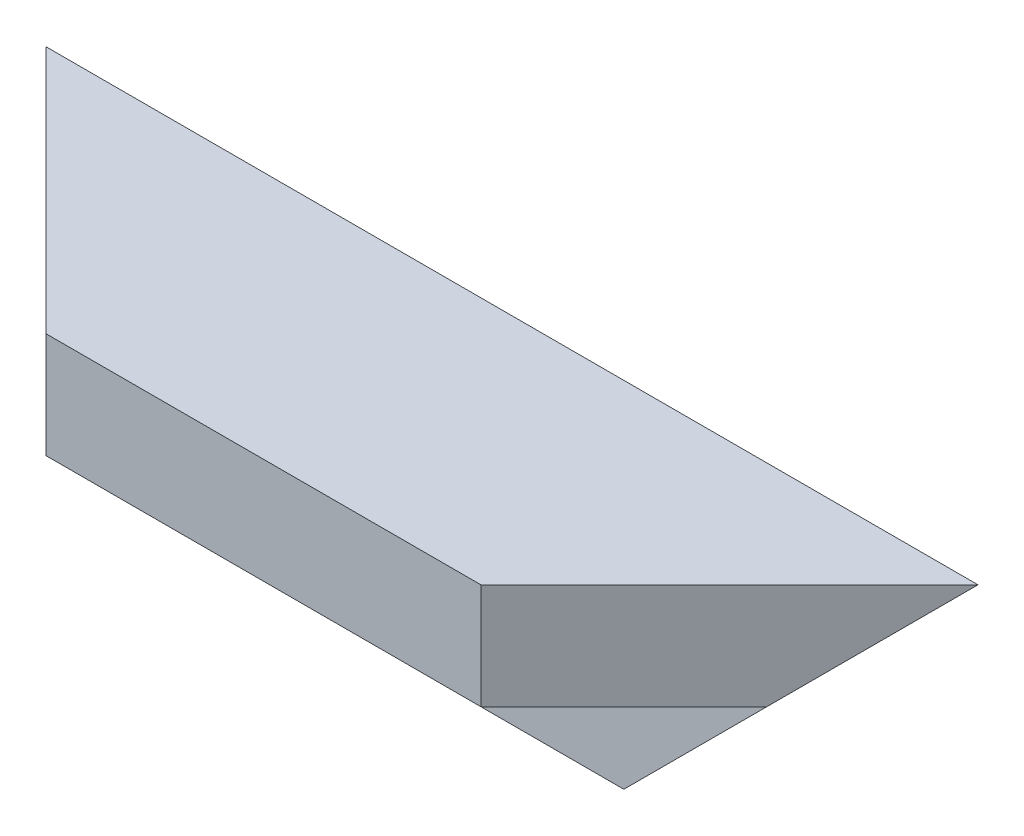
ISO-10303-21;
HEADER;
FILE_DESCRIPTION(('STEP AP214'),'2;1');
FILE_NAME('part.step','',(''),(''),'','','');
FILE_SCHEMA(('AUTOMOTIVE_DESIGN { 1 0 10303 214 1 1 1 1 }'));
ENDSEC;
DATA;
#1=APPLICATION_CONTEXT('core data for automotive mechanical design processes');
#2=APPLICATION_PROTOCOL_DEFINITION('international standard','automotive_design',2000,#1);
#3=PRODUCT_CONTEXT('',#1,'mechanical');
#4=PRODUCT('Part','Part','',(#3));
#5=PRODUCT_RELATED_PRODUCT_CATEGORY('part','',(#4));
#6=PRODUCT_DEFINITION_FORMATION('','',#4);
#7=PRODUCT_DEFINITION_CONTEXT('part definition',#1,'design');
#8=PRODUCT_DEFINITION('design','',#6,#7);
#9=PRODUCT_DEFINITION_SHAPE('','',#8);
#10=(LENGTH_UNIT() NAMED_UNIT(*) SI_UNIT(.MILLI.,.METRE.));
#11=(NAMED_UNIT(*) PLANE_ANGLE_UNIT() SI_UNIT($,.RADIAN.));
#12=(NAMED_UNIT(*) SI_UNIT($,.STERADIAN.) SOLID_ANGLE_UNIT());
#13=UNCERTAINTY_MEASURE_WITH_UNIT(LENGTH_MEASURE(1.E-05),#10,'distance_accuracy_value','');
#14=(GEOMETRIC_REPRESENTATION_CONTEXT(3) GLOBAL_UNCERTAINTY_ASSIGNED_CONTEXT((#13)) GLOBAL_UNIT_ASSIGNED_CONTEXT((#10,
#11,#12)) REPRESENTATION_CONTEXT('',''));
#15=CARTESIAN_POINT('',(0.,0.,0.));
#16=DIRECTION('',(0.,0.,1.));
#17=DIRECTION('',(1.,0.,0.));
#18=AXIS2_PLACEMENT_3D('',#15,#16,#17);
#19=CARTESIAN_POINT('',(150.,-40.,0.));
#20=DIRECTION('',(0.,0.,1.));
#21=DIRECTION('',(1.,0.,0.));
#22=AXIS2_PLACEMENT_3D('',#19,#20,#21);
#23=PLANE('',#22);
#24=DIRECTION('',(-1.,0.,0.));
#25=VECTOR('',#24,1.);
#26=CARTESIAN_POINT('',(150.,0.,0.));
#27=LINE('',#26,#25);
#28=CARTESIAN_POINT('',(150.,0.,0.));
#29=VERTEX_POINT('',#28);
#30=CARTESIAN_POINT('',(0.,0.,0.));
#31=VERTEX_POINT('',#30);
#32=EDGE_CURVE('E110',#29,#31,#27,.T.);
#33=ORIENTED_EDGE('',*,*,#32,.F.);
#34=DIRECTION('',(0.707106781186548,0.707106781186547,0.));
#35=VECTOR('',#34,1.);
#36=CARTESIAN_POINT('',(150.,0.,0.));
#37=LINE('',#36,#35);
#38=CARTESIAN_POINT('',(110.,-40.,0.));
#39=VERTEX_POINT('',#38);
#40=EDGE_CURVE('E94',#39,#29,#37,.T.);
#41=ORIENTED_EDGE('',*,*,#40,.F.);
#42=DIRECTION('',(-1.,0.,0.));
#43=VECTOR('',#42,1.);
#44=CARTESIAN_POINT('',(150.,-40.,0.));
#45=LINE('',#44,#43);
#46=CARTESIAN_POINT('',(40.,-40.,0.));
#47=VERTEX_POINT('',#46);
#48=EDGE_CURVE('E108',#39,#47,#45,.T.);
#49=ORIENTED_EDGE('',*,*,#48,.T.);
#50=DIRECTION('',(0.707106781186548,-0.707106781186548,0.));
#51=VECTOR('',#50,1.);
#52=CARTESIAN_POINT('',(0.,0.,0.));
#53=LINE('',#52,#51);
#54=EDGE_CURVE('E176',#31,#47,#53,.T.);
#55=ORIENTED_EDGE('',*,*,#54,.F.);
#56=EDGE_LOOP('',(#33,#41,#49,#55));
#57=FACE_BOUND('',#56,.T.);
#58=ADVANCED_FACE('F39',(#57),#23,.F.);
#59=CARTESIAN_POINT('',(150.,0.,0.));
#60=DIRECTION('',(0.,-1.,0.));
#61=DIRECTION('',(0.,0.,-1.));
#62=AXIS2_PLACEMENT_3D('',#59,#60,#61);
#63=PLANE('',#62);
#64=DIRECTION('',(-1.,0.,0.));
#65=VECTOR('',#64,1.);
#66=CARTESIAN_POINT('',(150.,0.,40.));
#67=LINE('',#66,#65);
#68=CARTESIAN_POINT('',(110.,0.,40.));
#69=VERTEX_POINT('',#68);
#70=CARTESIAN_POINT('',(40.,0.,40.));
#71=VERTEX_POINT('',#70);
#72=EDGE_CURVE('E135',#69,#71,#67,.T.);
#73=ORIENTED_EDGE('',*,*,#72,.F.);
#74=DIRECTION('',(-0.707106781186548,0.,0.707106781186547));
#75=VECTOR('',#74,1.);
#76=CARTESIAN_POINT('',(150.,0.,0.));
#77=LINE('',#76,#75);
#78=EDGE_CURVE('E143',#29,#69,#77,.T.);
#79=ORIENTED_EDGE('',*,*,#78,.F.);
#80=ORIENTED_EDGE('',*,*,#32,.T.);
#81=DIRECTION('',(-0.707106781186548,0.,-0.707106781186547));
#82=VECTOR('',#81,1.);
#83=CARTESIAN_POINT('',(40.,0.,40.));
#84=LINE('',#83,#82);
#85=EDGE_CURVE('E155',#71,#31,#84,.T.);
#86=ORIENTED_EDGE('',*,*,#85,.F.);
#87=EDGE_LOOP('',(#73,#79,#80,#86));
#88=FACE_BOUND('',#87,.T.);
#89=ADVANCED_FACE('F147',(#88),#63,.F.);
#90=CARTESIAN_POINT('',(150.,0.,40.));
#91=DIRECTION('',(0.,0.,-1.));
#92=DIRECTION('',(-1.,0.,0.));
#93=AXIS2_PLACEMENT_3D('',#90,#91,#92);
#94=PLANE('',#93);
#95=DIRECTION('',(-1.,0.,0.));
#96=VECTOR('',#95,1.);
#97=CARTESIAN_POINT('',(150.,-17.,40.));
#98=LINE('',#97,#96);
#99=CARTESIAN_POINT('',(110.,-17.,40.));
#100=VERTEX_POINT('',#99);
#101=CARTESIAN_POINT('',(40.,-17.,40.));
#102=VERTEX_POINT('',#101);
#103=EDGE_CURVE('E131',#100,#102,#98,.T.);
#104=ORIENTED_EDGE('',*,*,#103,.F.);
#105=DIRECTION('',(0.,1.,0.));
#106=VECTOR('',#105,1.);
#107=CARTESIAN_POINT('',(110.,-40.,40.));
#108=LINE('',#107,#106);
#109=EDGE_CURVE('E54',#100,#69,#108,.T.);
#110=ORIENTED_EDGE('',*,*,#109,.T.);
#111=ORIENTED_EDGE('',*,*,#72,.T.);
#112=DIRECTION('',(0.,1.,0.));
#113=VECTOR('',#112,1.);
#114=CARTESIAN_POINT('',(40.,-40.,40.));
#115=LINE('',#114,#113);
#116=EDGE_CURVE('E150',#102,#71,#115,.T.);
#117=ORIENTED_EDGE('',*,*,#116,.F.);
#118=EDGE_LOOP('',(#104,#110,#111,#117));
#119=FACE_BOUND('',#118,.T.);
#120=ADVANCED_FACE('F181',(#119),#94,.F.);
#121=CARTESIAN_POINT('',(150.,-17.,40.));
#122=DIRECTION('',(0.,1.,0.));
#123=DIRECTION('',(0.,0.,1.));
#124=AXIS2_PLACEMENT_3D('',#121,#122,#123);
#125=PLANE('',#124);
#126=DIRECTION('',(-1.,0.,0.));
#127=VECTOR('',#126,1.);
#128=CARTESIAN_POINT('',(150.,-17.,17.));
#129=LINE('',#128,#127);
#130=CARTESIAN_POINT('',(133.,-17.,17.));
#131=VERTEX_POINT('',#130);
#132=CARTESIAN_POINT('',(17.,-17.,17.));
#133=VERTEX_POINT('',#132);
#134=EDGE_CURVE('E122',#131,#133,#129,.T.);
#135=ORIENTED_EDGE('',*,*,#134,.F.);
#136=DIRECTION('',(-0.707106781186548,0.,0.707106781186547));
#137=VECTOR('',#136,1.);
#138=CARTESIAN_POINT('',(130.,-17.,19.9999999999999));
#139=LINE('',#138,#137);
#140=EDGE_CURVE('E118',#131,#100,#139,.T.);
#141=ORIENTED_EDGE('',*,*,#140,.T.);
#142=ORIENTED_EDGE('',*,*,#103,.T.);
#143=DIRECTION('',(-0.707106781186548,0.,-0.707106781186548));
#144=VECTOR('',#143,1.);
#145=CARTESIAN_POINT('',(95.,-17.,95.));
#146=LINE('',#145,#144);
#147=EDGE_CURVE('E124',#102,#133,#146,.T.);
#148=ORIENTED_EDGE('',*,*,#147,.T.);
#149=EDGE_LOOP('',(#135,#141,#142,#148));
#150=FACE_BOUND('',#149,.T.);
#151=ADVANCED_FACE('F165',(#150),#125,.F.);
#152=CARTESIAN_POINT('',(150.,-17.,17.));
#153=DIRECTION('',(0.,0.,-1.));
#154=DIRECTION('',(0.,1.,0.));
#155=AXIS2_PLACEMENT_3D('',#152,#153,#154);
#156=PLANE('',#155);
#157=DIRECTION('',(-1.,0.,0.));
#158=VECTOR('',#157,1.);
#159=CARTESIAN_POINT('',(150.,-40.,17.));
#160=LINE('',#159,#158);
#161=CARTESIAN_POINT('',(110.,-40.,17.));
#162=VERTEX_POINT('',#161);
#163=CARTESIAN_POINT('',(40.,-40.,17.));
#164=VERTEX_POINT('',#163);
#165=EDGE_CURVE('E117',#162,#164,#160,.T.);
#166=ORIENTED_EDGE('',*,*,#165,.F.);
#167=DIRECTION('',(0.707106781186548,0.707106781186547,0.));
#168=VECTOR('',#167,1.);
#169=CARTESIAN_POINT('',(141.5,-8.49999999999994,17.));
#170=LINE('',#169,#168);
#171=EDGE_CURVE('E97',#162,#131,#170,.T.);
#172=ORIENTED_EDGE('',*,*,#171,.T.);
#173=ORIENTED_EDGE('',*,*,#134,.T.);
#174=DIRECTION('',(0.707106781186548,-0.707106781186548,0.));
#175=VECTOR('',#174,1.);
#176=CARTESIAN_POINT('',(83.5,-83.5,17.));
#177=LINE('',#176,#175);
#178=EDGE_CURVE('E62',#133,#164,#177,.T.);
#179=ORIENTED_EDGE('',*,*,#178,.T.);
#180=EDGE_LOOP('',(#166,#172,#173,#179));
#181=FACE_BOUND('',#180,.T.);
#182=ADVANCED_FACE('F170',(#181),#156,.F.);
#183=CARTESIAN_POINT('',(150.,-40.,17.));
#184=DIRECTION('',(0.,1.,0.));
#185=DIRECTION('',(0.,0.,1.));
#186=AXIS2_PLACEMENT_3D('',#183,#184,#185);
#187=PLANE('',#186);
#188=ORIENTED_EDGE('',*,*,#48,.F.);
#189=DIRECTION('',(0.,0.,-1.));
#190=VECTOR('',#189,1.);
#191=CARTESIAN_POINT('',(110.,-40.,40.));
#192=LINE('',#191,#190);
#193=EDGE_CURVE('E91',#162,#39,#192,.T.);
#194=ORIENTED_EDGE('',*,*,#193,.F.);
#195=ORIENTED_EDGE('',*,*,#165,.T.);
#196=DIRECTION('',(0.,0.,-1.));
#197=VECTOR('',#196,1.);
#198=CARTESIAN_POINT('',(40.,-40.,40.));
#199=LINE('',#198,#197);
#200=EDGE_CURVE('E112',#164,#47,#199,.T.);
#201=ORIENTED_EDGE('',*,*,#200,.T.);
#202=EDGE_LOOP('',(#188,#194,#195,#201));
#203=FACE_BOUND('',#202,.T.);
#204=ADVANCED_FACE('F115',(#203),#187,.F.);
#205=CARTESIAN_POINT('',(40.,-40.,40.));
#206=DIRECTION('',(0.707106781186548,0.,-0.707106781186548));
#207=DIRECTION('',(-0.707106781186548,0.,-0.707106781186548));
#208=AXIS2_PLACEMENT_3D('',#205,#206,#207);
#209=PLANE('',#208);
#210=ORIENTED_EDGE('',*,*,#85,.T.);
#211=DIRECTION('',(0.577350269189626,-0.577350269189626,0.577350269189626));
#212=VECTOR('',#211,1.);
#213=CARTESIAN_POINT('',(40.,-40.,40.));
#214=LINE('',#213,#212);
#215=EDGE_CURVE('E11',#31,#133,#214,.T.);
#216=ORIENTED_EDGE('',*,*,#215,.T.);
#217=ORIENTED_EDGE('',*,*,#147,.F.);
#218=ORIENTED_EDGE('',*,*,#116,.T.);
#219=EDGE_LOOP('',(#210,#216,#217,#218));
#220=FACE_BOUND('',#219,.T.);
#221=ADVANCED_FACE('F179',(#220),#209,.F.);
#222=CARTESIAN_POINT('',(150.,-40.,0.));
#223=DIRECTION('',(-0.707106781186547,0.,-0.707106781186548));
#224=DIRECTION('',(-0.707106781186548,0.,0.707106781186547));
#225=AXIS2_PLACEMENT_3D('',#222,#223,#224);
#226=PLANE('',#225);
#227=ORIENTED_EDGE('',*,*,#140,.F.);
#228=DIRECTION('',(0.577350269189626,0.577350269189626,-0.577350269189626));
#229=VECTOR('',#228,1.);
#230=CARTESIAN_POINT('',(136.666666666667,-13.3333333333333,13.3333333333333));
#231=LINE('',#230,#229);
#232=EDGE_CURVE('E47',#131,#29,#231,.T.);
#233=ORIENTED_EDGE('',*,*,#232,.T.);
#234=ORIENTED_EDGE('',*,*,#78,.T.);
#235=ORIENTED_EDGE('',*,*,#109,.F.);
#236=EDGE_LOOP('',(#227,#233,#234,#235));
#237=FACE_BOUND('',#236,.T.);
#238=ADVANCED_FACE('F142',(#237),#226,.F.);
#239=CARTESIAN_POINT('',(150.,0.,40.));
#240=DIRECTION('',(-0.707106781186547,0.707106781186548,0.));
#241=DIRECTION('',(-0.707106781186548,-0.707106781186547,0.));
#242=AXIS2_PLACEMENT_3D('',#239,#240,#241);
#243=PLANE('',#242);
#244=ORIENTED_EDGE('',*,*,#193,.T.);
#245=ORIENTED_EDGE('',*,*,#40,.T.);
#246=ORIENTED_EDGE('',*,*,#232,.F.);
#247=ORIENTED_EDGE('',*,*,#171,.F.);
#248=EDGE_LOOP('',(#244,#245,#246,#247));
#249=FACE_BOUND('',#248,.T.);
#250=ADVANCED_FACE('F93',(#249),#243,.F.);
#251=CARTESIAN_POINT('',(0.,0.,40.));
#252=DIRECTION('',(0.707106781186548,0.707106781186548,0.));
#253=DIRECTION('',(-0.707106781186548,0.707106781186548,0.));
#254=AXIS2_PLACEMENT_3D('',#251,#252,#253);
#255=PLANE('',#254);
#256=ORIENTED_EDGE('',*,*,#215,.F.);
#257=ORIENTED_EDGE('',*,*,#54,.T.);
#258=ORIENTED_EDGE('',*,*,#200,.F.);
#259=ORIENTED_EDGE('',*,*,#178,.F.);
#260=EDGE_LOOP('',(#256,#257,#258,#259));
#261=FACE_BOUND('',#260,.T.);
#262=ADVANCED_FACE('F178',(#261),#255,.F.);
#263=CLOSED_SHELL('',(#58,#89,#120,#151,#182,#204,#221,#238,#250,#262));
#264=MANIFOLD_SOLID_BREP('B2',#263);
#265=ADVANCED_BREP_SHAPE_REPRESENTATION('',(#18,#264),#14);
#266=SHAPE_DEFINITION_REPRESENTATION(#9,#265);
ENDSEC;
END-ISO-10303-21;
